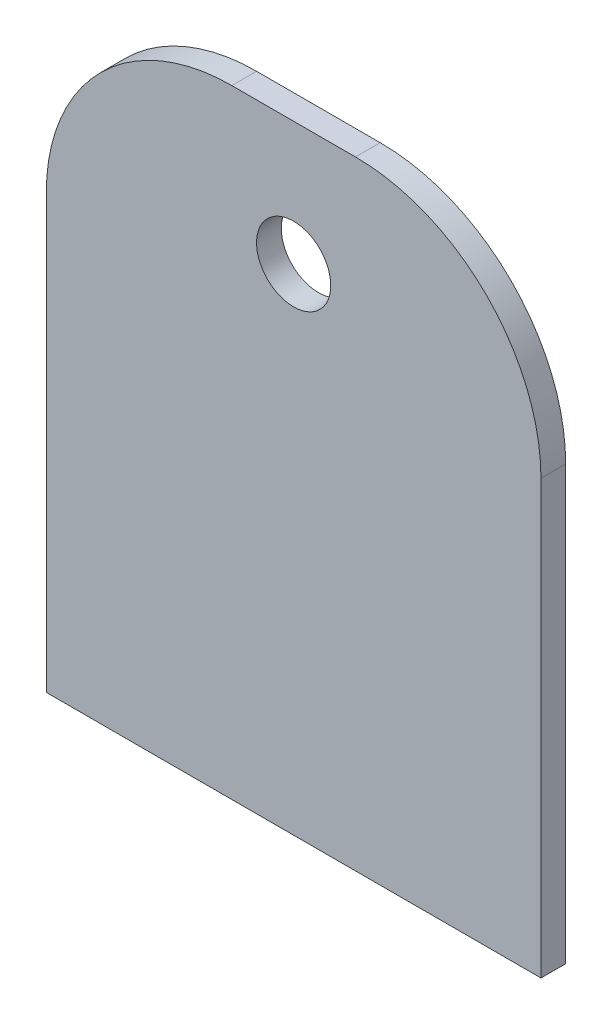
ISO-10303-21;
HEADER;
FILE_DESCRIPTION(('STEP AP214'),'2;1');
FILE_NAME('part.step','',(''),(''),'','','');
FILE_SCHEMA(('AUTOMOTIVE_DESIGN { 1 0 10303 214 1 1 1 1 }'));
ENDSEC;
DATA;
#1=APPLICATION_CONTEXT('core data for automotive mechanical design processes');
#2=APPLICATION_PROTOCOL_DEFINITION('international standard','automotive_design',2000,#1);
#3=PRODUCT_CONTEXT('',#1,'mechanical');
#4=PRODUCT('Part','Part','',(#3));
#5=PRODUCT_RELATED_PRODUCT_CATEGORY('part','',(#4));
#6=PRODUCT_DEFINITION_FORMATION('','',#4);
#7=PRODUCT_DEFINITION_CONTEXT('part definition',#1,'design');
#8=PRODUCT_DEFINITION('design','',#6,#7);
#9=PRODUCT_DEFINITION_SHAPE('','',#8);
#10=(LENGTH_UNIT() NAMED_UNIT(*) SI_UNIT(.MILLI.,.METRE.));
#11=(NAMED_UNIT(*) PLANE_ANGLE_UNIT() SI_UNIT($,.RADIAN.));
#12=(NAMED_UNIT(*) SI_UNIT($,.STERADIAN.) SOLID_ANGLE_UNIT());
#13=UNCERTAINTY_MEASURE_WITH_UNIT(LENGTH_MEASURE(1.E-05),#10,'distance_accuracy_value','');
#14=(GEOMETRIC_REPRESENTATION_CONTEXT(3) GLOBAL_UNCERTAINTY_ASSIGNED_CONTEXT((#13)) GLOBAL_UNIT_ASSIGNED_CONTEXT((#10,
#11,#12)) REPRESENTATION_CONTEXT('',''));
#15=CARTESIAN_POINT('',(0.,0.,0.));
#16=DIRECTION('',(0.,0.,1.));
#17=DIRECTION('',(1.,0.,0.));
#18=AXIS2_PLACEMENT_3D('',#15,#16,#17);
#19=CARTESIAN_POINT('',(-15.,35.,2.));
#20=DIRECTION('',(0.,0.,1.));
#21=DIRECTION('',(1.,0.,0.));
#22=AXIS2_PLACEMENT_3D('',#19,#20,#21);
#23=PLANE('',#22);
#24=DIRECTION('',(0.,1.,0.));
#25=VECTOR('',#24,1.);
#26=CARTESIAN_POINT('',(0.,0.,2.));
#27=LINE('',#26,#25);
#28=CARTESIAN_POINT('',(0.,0.,2.));
#29=VERTEX_POINT('',#28);
#30=CARTESIAN_POINT('',(0.,34.9999999999999,2.));
#31=VERTEX_POINT('',#30);
#32=EDGE_CURVE('E130',#29,#31,#27,.T.);
#33=ORIENTED_EDGE('',*,*,#32,.T.);
#34=CARTESIAN_POINT('',(-15.,35.,2.));
#35=DIRECTION('',(0.,0.,1.));
#36=DIRECTION('',(1.,0.,0.));
#37=AXIS2_PLACEMENT_3D('',#34,#35,#36);
#38=CIRCLE('',#37,15.);
#39=CARTESIAN_POINT('',(-15.0000000000001,50.,2.));
#40=VERTEX_POINT('',#39);
#41=EDGE_CURVE('E88',#31,#40,#38,.T.);
#42=ORIENTED_EDGE('',*,*,#41,.T.);
#43=DIRECTION('',(-1.,0.,0.));
#44=VECTOR('',#43,1.);
#45=CARTESIAN_POINT('',(-15.0000000000001,50.,2.));
#46=LINE('',#45,#44);
#47=CARTESIAN_POINT('',(-24.9999999999999,50.,2.));
#48=VERTEX_POINT('',#47);
#49=EDGE_CURVE('E101',#40,#48,#46,.T.);
#50=ORIENTED_EDGE('',*,*,#49,.T.);
#51=CARTESIAN_POINT('',(-25.,35.,2.));
#52=DIRECTION('',(0.,0.,1.));
#53=DIRECTION('',(1.,0.,0.));
#54=AXIS2_PLACEMENT_3D('',#51,#52,#53);
#55=CIRCLE('',#54,15.);
#56=CARTESIAN_POINT('',(-40.,34.9999999999999,2.));
#57=VERTEX_POINT('',#56);
#58=EDGE_CURVE('E95',#48,#57,#55,.T.);
#59=ORIENTED_EDGE('',*,*,#58,.T.);
#60=DIRECTION('',(0.,-1.,0.));
#61=VECTOR('',#60,1.);
#62=CARTESIAN_POINT('',(-40.,0.,2.));
#63=LINE('',#62,#61);
#64=CARTESIAN_POINT('',(-40.,0.,2.));
#65=VERTEX_POINT('',#64);
#66=EDGE_CURVE('E99',#57,#65,#63,.T.);
#67=ORIENTED_EDGE('',*,*,#66,.T.);
#68=DIRECTION('',(1.,0.,0.));
#69=VECTOR('',#68,1.);
#70=CARTESIAN_POINT('',(0.,0.,2.));
#71=LINE('',#70,#69);
#72=EDGE_CURVE('E51',#65,#29,#71,.T.);
#73=ORIENTED_EDGE('',*,*,#72,.T.);
#74=EDGE_LOOP('',(#33,#42,#50,#59,#67,#73));
#75=FACE_BOUND('',#74,.T.);
#76=CARTESIAN_POINT('',(-20.,40.,2.));
#77=DIRECTION('',(0.,0.,1.));
#78=DIRECTION('',(1.,0.,0.));
#79=AXIS2_PLACEMENT_3D('',#76,#77,#78);
#80=CIRCLE('',#79,3.);
#81=CARTESIAN_POINT('',(-17.,40.,2.));
#82=VERTEX_POINT('',#81);
#83=EDGE_CURVE('E123',#82,#82,#80,.T.);
#84=ORIENTED_EDGE('',*,*,#83,.F.);
#85=EDGE_LOOP('',(#84));
#86=FACE_BOUND('',#85,.T.);
#87=ADVANCED_FACE('F34',(#75,#86),#23,.T.);
#88=CARTESIAN_POINT('',(-15.,35.,0.));
#89=DIRECTION('',(0.,0.,1.));
#90=DIRECTION('',(1.,0.,0.));
#91=AXIS2_PLACEMENT_3D('',#88,#89,#90);
#92=PLANE('',#91);
#93=DIRECTION('',(0.,1.,0.));
#94=VECTOR('',#93,1.);
#95=CARTESIAN_POINT('',(0.,0.,0.));
#96=LINE('',#95,#94);
#97=CARTESIAN_POINT('',(0.,0.,0.));
#98=VERTEX_POINT('',#97);
#99=CARTESIAN_POINT('',(0.,34.9999999999999,0.));
#100=VERTEX_POINT('',#99);
#101=EDGE_CURVE('E119',#98,#100,#96,.T.);
#102=ORIENTED_EDGE('',*,*,#101,.F.);
#103=DIRECTION('',(1.,0.,0.));
#104=VECTOR('',#103,1.);
#105=CARTESIAN_POINT('',(0.,0.,0.));
#106=LINE('',#105,#104);
#107=CARTESIAN_POINT('',(-40.,0.,0.));
#108=VERTEX_POINT('',#107);
#109=EDGE_CURVE('E80',#108,#98,#106,.T.);
#110=ORIENTED_EDGE('',*,*,#109,.F.);
#111=DIRECTION('',(0.,-1.,0.));
#112=VECTOR('',#111,1.);
#113=CARTESIAN_POINT('',(-40.,0.,0.));
#114=LINE('',#113,#112);
#115=CARTESIAN_POINT('',(-40.,34.9999999999999,0.));
#116=VERTEX_POINT('',#115);
#117=EDGE_CURVE('E74',#116,#108,#114,.T.);
#118=ORIENTED_EDGE('',*,*,#117,.F.);
#119=CARTESIAN_POINT('',(-25.,35.,0.));
#120=DIRECTION('',(0.,0.,1.));
#121=DIRECTION('',(1.,0.,0.));
#122=AXIS2_PLACEMENT_3D('',#119,#120,#121);
#123=CIRCLE('',#122,15.);
#124=CARTESIAN_POINT('',(-24.9999999999999,50.,0.));
#125=VERTEX_POINT('',#124);
#126=EDGE_CURVE('E109',#125,#116,#123,.T.);
#127=ORIENTED_EDGE('',*,*,#126,.F.);
#128=DIRECTION('',(-1.,0.,0.));
#129=VECTOR('',#128,1.);
#130=CARTESIAN_POINT('',(-15.0000000000001,50.,0.));
#131=LINE('',#130,#129);
#132=CARTESIAN_POINT('',(-15.0000000000001,50.,0.));
#133=VERTEX_POINT('',#132);
#134=EDGE_CURVE('E125',#133,#125,#131,.T.);
#135=ORIENTED_EDGE('',*,*,#134,.F.);
#136=CARTESIAN_POINT('',(-15.,35.,0.));
#137=DIRECTION('',(0.,0.,1.));
#138=DIRECTION('',(1.,0.,0.));
#139=AXIS2_PLACEMENT_3D('',#136,#137,#138);
#140=CIRCLE('',#139,15.);
#141=EDGE_CURVE('E122',#100,#133,#140,.T.);
#142=ORIENTED_EDGE('',*,*,#141,.F.);
#143=EDGE_LOOP('',(#102,#110,#118,#127,#135,#142));
#144=FACE_BOUND('',#143,.T.);
#145=CARTESIAN_POINT('',(-20.,40.,0.));
#146=DIRECTION('',(0.,0.,1.));
#147=DIRECTION('',(1.,0.,0.));
#148=AXIS2_PLACEMENT_3D('',#145,#146,#147);
#149=CIRCLE('',#148,3.);
#150=CARTESIAN_POINT('',(-17.,40.,0.));
#151=VERTEX_POINT('',#150);
#152=EDGE_CURVE('E223',#151,#151,#149,.T.);
#153=ORIENTED_EDGE('',*,*,#152,.T.);
#154=EDGE_LOOP('',(#153));
#155=FACE_BOUND('',#154,.T.);
#156=ADVANCED_FACE('F139',(#144,#155),#92,.F.);
#157=CARTESIAN_POINT('',(0.,0.,2.));
#158=DIRECTION('',(-1.,0.,0.));
#159=DIRECTION('',(0.,0.,1.));
#160=AXIS2_PLACEMENT_3D('',#157,#158,#159);
#161=PLANE('',#160);
#162=ORIENTED_EDGE('',*,*,#101,.T.);
#163=DIRECTION('',(0.,0.,-1.));
#164=VECTOR('',#163,1.);
#165=CARTESIAN_POINT('',(0.,34.9999999999999,2.));
#166=LINE('',#165,#164);
#167=EDGE_CURVE('E11',#31,#100,#166,.T.);
#168=ORIENTED_EDGE('',*,*,#167,.F.);
#169=ORIENTED_EDGE('',*,*,#32,.F.);
#170=DIRECTION('',(0.,0.,-1.));
#171=VECTOR('',#170,1.);
#172=CARTESIAN_POINT('',(0.,0.,2.));
#173=LINE('',#172,#171);
#174=EDGE_CURVE('E115',#29,#98,#173,.T.);
#175=ORIENTED_EDGE('',*,*,#174,.T.);
#176=EDGE_LOOP('',(#162,#168,#169,#175));
#177=FACE_BOUND('',#176,.T.);
#178=ADVANCED_FACE('F36',(#177),#161,.F.);
#179=CARTESIAN_POINT('',(-15.,35.,2.));
#180=DIRECTION('',(0.,0.,-1.));
#181=DIRECTION('',(-1.,0.,0.));
#182=AXIS2_PLACEMENT_3D('',#179,#180,#181);
#183=CYLINDRICAL_SURFACE('',#182,15.);
#184=ORIENTED_EDGE('',*,*,#141,.T.);
#185=DIRECTION('',(0.,0.,-1.));
#186=VECTOR('',#185,1.);
#187=CARTESIAN_POINT('',(-15.0000000000001,50.,2.));
#188=LINE('',#187,#186);
#189=EDGE_CURVE('E43',#40,#133,#188,.T.);
#190=ORIENTED_EDGE('',*,*,#189,.F.);
#191=ORIENTED_EDGE('',*,*,#41,.F.);
#192=ORIENTED_EDGE('',*,*,#167,.T.);
#193=EDGE_LOOP('',(#184,#190,#191,#192));
#194=FACE_BOUND('',#193,.T.);
#195=ADVANCED_FACE('F164',(#194),#183,.T.);
#196=CARTESIAN_POINT('',(-15.0000000000001,50.,2.));
#197=DIRECTION('',(0.,-1.,0.));
#198=DIRECTION('',(0.,0.,-1.));
#199=AXIS2_PLACEMENT_3D('',#196,#197,#198);
#200=PLANE('',#199);
#201=ORIENTED_EDGE('',*,*,#134,.T.);
#202=DIRECTION('',(0.,0.,-1.));
#203=VECTOR('',#202,1.);
#204=CARTESIAN_POINT('',(-24.9999999999999,50.,2.));
#205=LINE('',#204,#203);
#206=EDGE_CURVE('E110',#48,#125,#205,.T.);
#207=ORIENTED_EDGE('',*,*,#206,.F.);
#208=ORIENTED_EDGE('',*,*,#49,.F.);
#209=ORIENTED_EDGE('',*,*,#189,.T.);
#210=EDGE_LOOP('',(#201,#207,#208,#209));
#211=FACE_BOUND('',#210,.T.);
#212=ADVANCED_FACE('F136',(#211),#200,.F.);
#213=CARTESIAN_POINT('',(-25.,35.,2.));
#214=DIRECTION('',(0.,0.,-1.));
#215=DIRECTION('',(-1.,0.,0.));
#216=AXIS2_PLACEMENT_3D('',#213,#214,#215);
#217=CYLINDRICAL_SURFACE('',#216,15.);
#218=ORIENTED_EDGE('',*,*,#126,.T.);
#219=DIRECTION('',(0.,0.,-1.));
#220=VECTOR('',#219,1.);
#221=CARTESIAN_POINT('',(-40.,34.9999999999999,2.));
#222=LINE('',#221,#220);
#223=EDGE_CURVE('E106',#57,#116,#222,.T.);
#224=ORIENTED_EDGE('',*,*,#223,.F.);
#225=ORIENTED_EDGE('',*,*,#58,.F.);
#226=ORIENTED_EDGE('',*,*,#206,.T.);
#227=EDGE_LOOP('',(#218,#224,#225,#226));
#228=FACE_BOUND('',#227,.T.);
#229=ADVANCED_FACE('F107',(#228),#217,.T.);
#230=CARTESIAN_POINT('',(-40.,0.,2.));
#231=DIRECTION('',(1.,0.,0.));
#232=DIRECTION('',(0.,0.,-1.));
#233=AXIS2_PLACEMENT_3D('',#230,#231,#232);
#234=PLANE('',#233);
#235=ORIENTED_EDGE('',*,*,#117,.T.);
#236=DIRECTION('',(0.,0.,-1.));
#237=VECTOR('',#236,1.);
#238=CARTESIAN_POINT('',(-40.,0.,2.));
#239=LINE('',#238,#237);
#240=EDGE_CURVE('E111',#65,#108,#239,.T.);
#241=ORIENTED_EDGE('',*,*,#240,.F.);
#242=ORIENTED_EDGE('',*,*,#66,.F.);
#243=ORIENTED_EDGE('',*,*,#223,.T.);
#244=EDGE_LOOP('',(#235,#241,#242,#243));
#245=FACE_BOUND('',#244,.T.);
#246=ADVANCED_FACE('F113',(#245),#234,.F.);
#247=CARTESIAN_POINT('',(0.,0.,2.));
#248=DIRECTION('',(0.,1.,0.));
#249=DIRECTION('',(0.,0.,1.));
#250=AXIS2_PLACEMENT_3D('',#247,#248,#249);
#251=PLANE('',#250);
#252=ORIENTED_EDGE('',*,*,#109,.T.);
#253=ORIENTED_EDGE('',*,*,#174,.F.);
#254=ORIENTED_EDGE('',*,*,#72,.F.);
#255=ORIENTED_EDGE('',*,*,#240,.T.);
#256=EDGE_LOOP('',(#252,#253,#254,#255));
#257=FACE_BOUND('',#256,.T.);
#258=ADVANCED_FACE('F144',(#257),#251,.F.);
#259=CARTESIAN_POINT('',(-20.,40.,2.));
#260=DIRECTION('',(0.,0.,-1.));
#261=DIRECTION('',(-1.,0.,0.));
#262=AXIS2_PLACEMENT_3D('',#259,#260,#261);
#263=CYLINDRICAL_SURFACE('',#262,3.);
#264=ORIENTED_EDGE('',*,*,#83,.T.);
#265=EDGE_LOOP('',(#264));
#266=FACE_BOUND('',#265,.T.);
#267=ORIENTED_EDGE('',*,*,#152,.F.);
#268=EDGE_LOOP('',(#267));
#269=FACE_BOUND('',#268,.T.);
#270=ADVANCED_FACE('F146',(#266,#269),#263,.F.);
#271=CLOSED_SHELL('',(#87,#156,#178,#195,#212,#229,#246,#258,#270));
#272=MANIFOLD_SOLID_BREP('B2',#271);
#273=ADVANCED_BREP_SHAPE_REPRESENTATION('',(#18,#272),#14);
#274=SHAPE_DEFINITION_REPRESENTATION(#9,#273);
ENDSEC;
END-ISO-10303-21;
